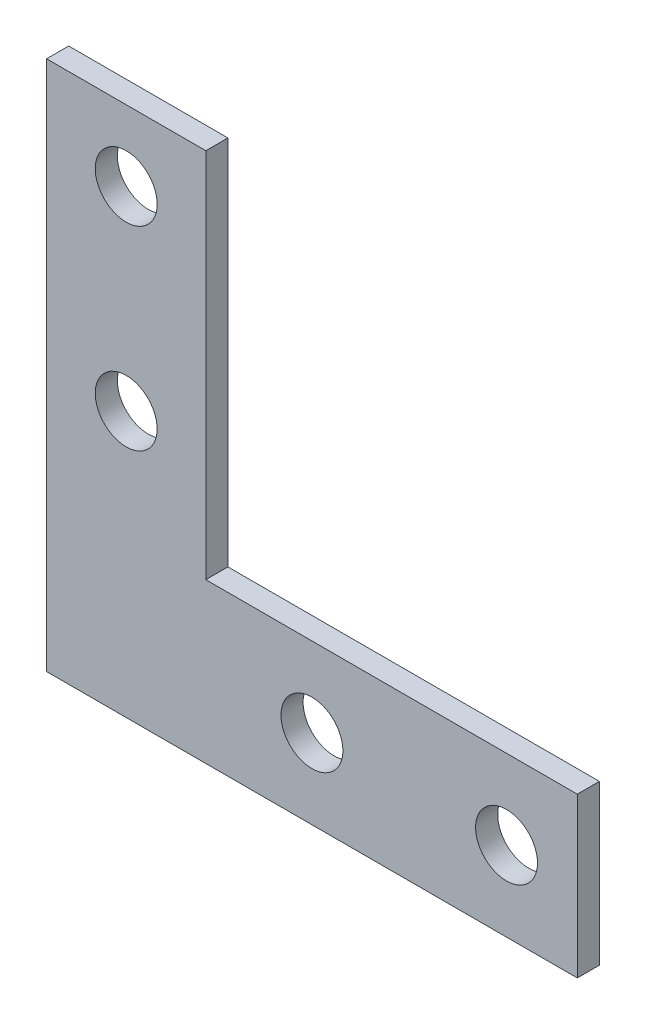
ISO-10303-21;
HEADER;
FILE_DESCRIPTION(('STEP AP214'),'2;1');
FILE_NAME('part.step','',(''),(''),'','','');
FILE_SCHEMA(('AUTOMOTIVE_DESIGN { 1 0 10303 214 1 1 1 1 }'));
ENDSEC;
DATA;
#1=APPLICATION_CONTEXT('core data for automotive mechanical design processes');
#2=APPLICATION_PROTOCOL_DEFINITION('international standard','automotive_design',2000,#1);
#3=PRODUCT_CONTEXT('',#1,'mechanical');
#4=PRODUCT('Part','Part','',(#3));
#5=PRODUCT_RELATED_PRODUCT_CATEGORY('part','',(#4));
#6=PRODUCT_DEFINITION_FORMATION('','',#4);
#7=PRODUCT_DEFINITION_CONTEXT('part definition',#1,'design');
#8=PRODUCT_DEFINITION('design','',#6,#7);
#9=PRODUCT_DEFINITION_SHAPE('','',#8);
#10=(LENGTH_UNIT() NAMED_UNIT(*) SI_UNIT(.MILLI.,.METRE.));
#11=(NAMED_UNIT(*) PLANE_ANGLE_UNIT() SI_UNIT($,.RADIAN.));
#12=(NAMED_UNIT(*) SI_UNIT($,.STERADIAN.) SOLID_ANGLE_UNIT());
#13=UNCERTAINTY_MEASURE_WITH_UNIT(LENGTH_MEASURE(1.E-05),#10,'distance_accuracy_value','');
#14=(GEOMETRIC_REPRESENTATION_CONTEXT(3) GLOBAL_UNCERTAINTY_ASSIGNED_CONTEXT((#13)) GLOBAL_UNIT_ASSIGNED_CONTEXT((#10,
#11,#12)) REPRESENTATION_CONTEXT('',''));
#15=CARTESIAN_POINT('',(0.,0.,0.));
#16=DIRECTION('',(0.,0.,1.));
#17=DIRECTION('',(1.,0.,0.));
#18=AXIS2_PLACEMENT_3D('',#15,#16,#17);
#19=CARTESIAN_POINT('',(0.,0.,2.5));
#20=DIRECTION('',(0.,0.,1.));
#21=DIRECTION('',(1.,0.,0.));
#22=AXIS2_PLACEMENT_3D('',#19,#20,#21);
#23=PLANE('',#22);
#24=CARTESIAN_POINT('',(30.,9.,2.5));
#25=DIRECTION('',(0.,0.,1.));
#26=DIRECTION('',(1.,0.,0.));
#27=AXIS2_PLACEMENT_3D('',#24,#25,#26);
#28=CIRCLE('',#27,3.5);
#29=CARTESIAN_POINT('',(33.5,9.,2.5));
#30=VERTEX_POINT('',#29);
#31=EDGE_CURVE('E190',#30,#30,#28,.T.);
#32=ORIENTED_EDGE('',*,*,#31,.F.);
#33=EDGE_LOOP('',(#32));
#34=FACE_BOUND('',#33,.T.);
#35=CARTESIAN_POINT('',(9.00000000000001,52.,2.5));
#36=DIRECTION('',(0.,0.,1.));
#37=DIRECTION('',(1.,0.,0.));
#38=AXIS2_PLACEMENT_3D('',#35,#36,#37);
#39=CIRCLE('',#38,3.5);
#40=CARTESIAN_POINT('',(12.5,52.,2.5));
#41=VERTEX_POINT('',#40);
#42=EDGE_CURVE('E123',#41,#41,#39,.T.);
#43=ORIENTED_EDGE('',*,*,#42,.F.);
#44=EDGE_LOOP('',(#43));
#45=FACE_BOUND('',#44,.T.);
#46=DIRECTION('',(-1.,0.,0.));
#47=VECTOR('',#46,1.);
#48=CARTESIAN_POINT('',(18.,60.,2.5));
#49=LINE('',#48,#47);
#50=CARTESIAN_POINT('',(18.,60.,2.5));
#51=VERTEX_POINT('',#50);
#52=CARTESIAN_POINT('',(0.,60.,2.5));
#53=VERTEX_POINT('',#52);
#54=EDGE_CURVE('E130',#51,#53,#49,.T.);
#55=ORIENTED_EDGE('',*,*,#54,.T.);
#56=DIRECTION('',(0.,-1.,0.));
#57=VECTOR('',#56,1.);
#58=CARTESIAN_POINT('',(0.,60.,2.5));
#59=LINE('',#58,#57);
#60=CARTESIAN_POINT('',(0.,0.,2.5));
#61=VERTEX_POINT('',#60);
#62=EDGE_CURVE('E88',#53,#61,#59,.T.);
#63=ORIENTED_EDGE('',*,*,#62,.T.);
#64=DIRECTION('',(1.,0.,0.));
#65=VECTOR('',#64,1.);
#66=CARTESIAN_POINT('',(0.,0.,2.5));
#67=LINE('',#66,#65);
#68=CARTESIAN_POINT('',(60.,0.,2.5));
#69=VERTEX_POINT('',#68);
#70=EDGE_CURVE('E101',#61,#69,#67,.T.);
#71=ORIENTED_EDGE('',*,*,#70,.T.);
#72=DIRECTION('',(0.,1.,0.));
#73=VECTOR('',#72,1.);
#74=CARTESIAN_POINT('',(60.,0.,2.5));
#75=LINE('',#74,#73);
#76=CARTESIAN_POINT('',(60.,18.,2.5));
#77=VERTEX_POINT('',#76);
#78=EDGE_CURVE('E95',#69,#77,#75,.T.);
#79=ORIENTED_EDGE('',*,*,#78,.T.);
#80=DIRECTION('',(-1.,0.,0.));
#81=VECTOR('',#80,1.);
#82=CARTESIAN_POINT('',(60.,18.,2.5));
#83=LINE('',#82,#81);
#84=CARTESIAN_POINT('',(18.,18.,2.5));
#85=VERTEX_POINT('',#84);
#86=EDGE_CURVE('E99',#77,#85,#83,.T.);
#87=ORIENTED_EDGE('',*,*,#86,.T.);
#88=DIRECTION('',(0.,1.,0.));
#89=VECTOR('',#88,1.);
#90=CARTESIAN_POINT('',(18.,18.,2.5));
#91=LINE('',#90,#89);
#92=EDGE_CURVE('E51',#85,#51,#91,.T.);
#93=ORIENTED_EDGE('',*,*,#92,.T.);
#94=EDGE_LOOP('',(#55,#63,#71,#79,#87,#93));
#95=FACE_BOUND('',#94,.T.);
#96=CARTESIAN_POINT('',(9.00000000000001,30.,2.5));
#97=DIRECTION('',(0.,0.,1.));
#98=DIRECTION('',(1.,0.,0.));
#99=AXIS2_PLACEMENT_3D('',#96,#97,#98);
#100=CIRCLE('',#99,3.5);
#101=CARTESIAN_POINT('',(12.5,30.,2.5));
#102=VERTEX_POINT('',#101);
#103=EDGE_CURVE('E196',#102,#102,#100,.T.);
#104=ORIENTED_EDGE('',*,*,#103,.F.);
#105=EDGE_LOOP('',(#104));
#106=FACE_BOUND('',#105,.T.);
#107=CARTESIAN_POINT('',(52.,9.,2.5));
#108=DIRECTION('',(0.,0.,1.));
#109=DIRECTION('',(1.,0.,0.));
#110=AXIS2_PLACEMENT_3D('',#107,#108,#109);
#111=CIRCLE('',#110,3.5);
#112=CARTESIAN_POINT('',(55.5,9.,2.5));
#113=VERTEX_POINT('',#112);
#114=EDGE_CURVE('E181',#113,#113,#111,.T.);
#115=ORIENTED_EDGE('',*,*,#114,.F.);
#116=EDGE_LOOP('',(#115));
#117=FACE_BOUND('',#116,.T.);
#118=ADVANCED_FACE('F34',(#34,#45,#95,#106,#117),#23,.T.);
#119=CARTESIAN_POINT('',(0.,0.,0.));
#120=DIRECTION('',(0.,0.,1.));
#121=DIRECTION('',(1.,0.,0.));
#122=AXIS2_PLACEMENT_3D('',#119,#120,#121);
#123=PLANE('',#122);
#124=DIRECTION('',(-1.,0.,0.));
#125=VECTOR('',#124,1.);
#126=CARTESIAN_POINT('',(18.,60.,0.));
#127=LINE('',#126,#125);
#128=CARTESIAN_POINT('',(18.,60.,0.));
#129=VERTEX_POINT('',#128);
#130=CARTESIAN_POINT('',(0.,60.,0.));
#131=VERTEX_POINT('',#130);
#132=EDGE_CURVE('E119',#129,#131,#127,.T.);
#133=ORIENTED_EDGE('',*,*,#132,.F.);
#134=DIRECTION('',(0.,1.,0.));
#135=VECTOR('',#134,1.);
#136=CARTESIAN_POINT('',(18.,18.,0.));
#137=LINE('',#136,#135);
#138=CARTESIAN_POINT('',(18.,18.,0.));
#139=VERTEX_POINT('',#138);
#140=EDGE_CURVE('E80',#139,#129,#137,.T.);
#141=ORIENTED_EDGE('',*,*,#140,.F.);
#142=DIRECTION('',(-1.,0.,0.));
#143=VECTOR('',#142,1.);
#144=CARTESIAN_POINT('',(60.,18.,0.));
#145=LINE('',#144,#143);
#146=CARTESIAN_POINT('',(60.,18.,0.));
#147=VERTEX_POINT('',#146);
#148=EDGE_CURVE('E74',#147,#139,#145,.T.);
#149=ORIENTED_EDGE('',*,*,#148,.F.);
#150=DIRECTION('',(0.,1.,0.));
#151=VECTOR('',#150,1.);
#152=CARTESIAN_POINT('',(60.,0.,0.));
#153=LINE('',#152,#151);
#154=CARTESIAN_POINT('',(60.,0.,0.));
#155=VERTEX_POINT('',#154);
#156=EDGE_CURVE('E109',#155,#147,#153,.T.);
#157=ORIENTED_EDGE('',*,*,#156,.F.);
#158=DIRECTION('',(1.,0.,0.));
#159=VECTOR('',#158,1.);
#160=CARTESIAN_POINT('',(0.,0.,0.));
#161=LINE('',#160,#159);
#162=CARTESIAN_POINT('',(0.,0.,0.));
#163=VERTEX_POINT('',#162);
#164=EDGE_CURVE('E125',#163,#155,#161,.T.);
#165=ORIENTED_EDGE('',*,*,#164,.F.);
#166=DIRECTION('',(0.,-1.,0.));
#167=VECTOR('',#166,1.);
#168=CARTESIAN_POINT('',(0.,60.,0.));
#169=LINE('',#168,#167);
#170=EDGE_CURVE('E122',#131,#163,#169,.T.);
#171=ORIENTED_EDGE('',*,*,#170,.F.);
#172=EDGE_LOOP('',(#133,#141,#149,#157,#165,#171));
#173=FACE_BOUND('',#172,.T.);
#174=CARTESIAN_POINT('',(9.00000000000001,52.,0.));
#175=DIRECTION('',(0.,0.,1.));
#176=DIRECTION('',(1.,0.,0.));
#177=AXIS2_PLACEMENT_3D('',#174,#175,#176);
#178=CIRCLE('',#177,3.5);
#179=CARTESIAN_POINT('',(12.5,52.,0.));
#180=VERTEX_POINT('',#179);
#181=EDGE_CURVE('E199',#180,#180,#178,.T.);
#182=ORIENTED_EDGE('',*,*,#181,.T.);
#183=EDGE_LOOP('',(#182));
#184=FACE_BOUND('',#183,.T.);
#185=CARTESIAN_POINT('',(9.00000000000001,30.,0.));
#186=DIRECTION('',(0.,0.,1.));
#187=DIRECTION('',(1.,0.,0.));
#188=AXIS2_PLACEMENT_3D('',#185,#186,#187);
#189=CIRCLE('',#188,3.5);
#190=CARTESIAN_POINT('',(12.5,30.,0.));
#191=VERTEX_POINT('',#190);
#192=EDGE_CURVE('E193',#191,#191,#189,.T.);
#193=ORIENTED_EDGE('',*,*,#192,.T.);
#194=EDGE_LOOP('',(#193));
#195=FACE_BOUND('',#194,.T.);
#196=CARTESIAN_POINT('',(30.,9.,0.));
#197=DIRECTION('',(0.,0.,1.));
#198=DIRECTION('',(1.,0.,0.));
#199=AXIS2_PLACEMENT_3D('',#196,#197,#198);
#200=CIRCLE('',#199,3.5);
#201=CARTESIAN_POINT('',(33.5,9.,0.));
#202=VERTEX_POINT('',#201);
#203=EDGE_CURVE('E187',#202,#202,#200,.T.);
#204=ORIENTED_EDGE('',*,*,#203,.T.);
#205=EDGE_LOOP('',(#204));
#206=FACE_BOUND('',#205,.T.);
#207=CARTESIAN_POINT('',(52.,9.,0.));
#208=DIRECTION('',(0.,0.,1.));
#209=DIRECTION('',(1.,0.,0.));
#210=AXIS2_PLACEMENT_3D('',#207,#208,#209);
#211=CIRCLE('',#210,3.5);
#212=CARTESIAN_POINT('',(55.5,9.,0.));
#213=VERTEX_POINT('',#212);
#214=EDGE_CURVE('E184',#213,#213,#211,.T.);
#215=ORIENTED_EDGE('',*,*,#214,.T.);
#216=EDGE_LOOP('',(#215));
#217=FACE_BOUND('',#216,.T.);
#218=ADVANCED_FACE('F139',(#173,#184,#195,#206,#217),#123,.F.);
#219=CARTESIAN_POINT('',(18.,60.,2.5));
#220=DIRECTION('',(0.,-1.,0.));
#221=DIRECTION('',(0.,0.,-1.));
#222=AXIS2_PLACEMENT_3D('',#219,#220,#221);
#223=PLANE('',#222);
#224=ORIENTED_EDGE('',*,*,#132,.T.);
#225=DIRECTION('',(0.,0.,-1.));
#226=VECTOR('',#225,1.);
#227=CARTESIAN_POINT('',(0.,60.,2.5));
#228=LINE('',#227,#226);
#229=EDGE_CURVE('E11',#53,#131,#228,.T.);
#230=ORIENTED_EDGE('',*,*,#229,.F.);
#231=ORIENTED_EDGE('',*,*,#54,.F.);
#232=DIRECTION('',(0.,0.,-1.));
#233=VECTOR('',#232,1.);
#234=CARTESIAN_POINT('',(18.,60.,2.5));
#235=LINE('',#234,#233);
#236=EDGE_CURVE('E115',#51,#129,#235,.T.);
#237=ORIENTED_EDGE('',*,*,#236,.T.);
#238=EDGE_LOOP('',(#224,#230,#231,#237));
#239=FACE_BOUND('',#238,.T.);
#240=ADVANCED_FACE('F36',(#239),#223,.F.);
#241=CARTESIAN_POINT('',(0.,60.,2.5));
#242=DIRECTION('',(1.,0.,0.));
#243=DIRECTION('',(0.,1.,0.));
#244=AXIS2_PLACEMENT_3D('',#241,#242,#243);
#245=PLANE('',#244);
#246=ORIENTED_EDGE('',*,*,#170,.T.);
#247=DIRECTION('',(0.,0.,-1.));
#248=VECTOR('',#247,1.);
#249=CARTESIAN_POINT('',(0.,0.,2.5));
#250=LINE('',#249,#248);
#251=EDGE_CURVE('E43',#61,#163,#250,.T.);
#252=ORIENTED_EDGE('',*,*,#251,.F.);
#253=ORIENTED_EDGE('',*,*,#62,.F.);
#254=ORIENTED_EDGE('',*,*,#229,.T.);
#255=EDGE_LOOP('',(#246,#252,#253,#254));
#256=FACE_BOUND('',#255,.T.);
#257=ADVANCED_FACE('F257',(#256),#245,.F.);
#258=CARTESIAN_POINT('',(0.,0.,2.5));
#259=DIRECTION('',(0.,1.,0.));
#260=DIRECTION('',(0.,0.,1.));
#261=AXIS2_PLACEMENT_3D('',#258,#259,#260);
#262=PLANE('',#261);
#263=ORIENTED_EDGE('',*,*,#164,.T.);
#264=DIRECTION('',(0.,0.,-1.));
#265=VECTOR('',#264,1.);
#266=CARTESIAN_POINT('',(60.,0.,2.5));
#267=LINE('',#266,#265);
#268=EDGE_CURVE('E110',#69,#155,#267,.T.);
#269=ORIENTED_EDGE('',*,*,#268,.F.);
#270=ORIENTED_EDGE('',*,*,#70,.F.);
#271=ORIENTED_EDGE('',*,*,#251,.T.);
#272=EDGE_LOOP('',(#263,#269,#270,#271));
#273=FACE_BOUND('',#272,.T.);
#274=ADVANCED_FACE('F136',(#273),#262,.F.);
#275=CARTESIAN_POINT('',(60.,0.,2.5));
#276=DIRECTION('',(-1.,0.,0.));
#277=DIRECTION('',(0.,0.,1.));
#278=AXIS2_PLACEMENT_3D('',#275,#276,#277);
#279=PLANE('',#278);
#280=ORIENTED_EDGE('',*,*,#156,.T.);
#281=DIRECTION('',(0.,0.,-1.));
#282=VECTOR('',#281,1.);
#283=CARTESIAN_POINT('',(60.,18.,2.5));
#284=LINE('',#283,#282);
#285=EDGE_CURVE('E106',#77,#147,#284,.T.);
#286=ORIENTED_EDGE('',*,*,#285,.F.);
#287=ORIENTED_EDGE('',*,*,#78,.F.);
#288=ORIENTED_EDGE('',*,*,#268,.T.);
#289=EDGE_LOOP('',(#280,#286,#287,#288));
#290=FACE_BOUND('',#289,.T.);
#291=ADVANCED_FACE('F107',(#290),#279,.F.);
#292=CARTESIAN_POINT('',(60.,18.,2.5));
#293=DIRECTION('',(0.,-1.,0.));
#294=DIRECTION('',(1.,0.,0.));
#295=AXIS2_PLACEMENT_3D('',#292,#293,#294);
#296=PLANE('',#295);
#297=ORIENTED_EDGE('',*,*,#148,.T.);
#298=DIRECTION('',(0.,0.,-1.));
#299=VECTOR('',#298,1.);
#300=CARTESIAN_POINT('',(18.,18.,2.5));
#301=LINE('',#300,#299);
#302=EDGE_CURVE('E111',#85,#139,#301,.T.);
#303=ORIENTED_EDGE('',*,*,#302,.F.);
#304=ORIENTED_EDGE('',*,*,#86,.F.);
#305=ORIENTED_EDGE('',*,*,#285,.T.);
#306=EDGE_LOOP('',(#297,#303,#304,#305));
#307=FACE_BOUND('',#306,.T.);
#308=ADVANCED_FACE('F113',(#307),#296,.F.);
#309=CARTESIAN_POINT('',(18.,18.,2.5));
#310=DIRECTION('',(-1.,0.,0.));
#311=DIRECTION('',(0.,0.,1.));
#312=AXIS2_PLACEMENT_3D('',#309,#310,#311);
#313=PLANE('',#312);
#314=ORIENTED_EDGE('',*,*,#140,.T.);
#315=ORIENTED_EDGE('',*,*,#236,.F.);
#316=ORIENTED_EDGE('',*,*,#92,.F.);
#317=ORIENTED_EDGE('',*,*,#302,.T.);
#318=EDGE_LOOP('',(#314,#315,#316,#317));
#319=FACE_BOUND('',#318,.T.);
#320=ADVANCED_FACE('F144',(#319),#313,.F.);
#321=CARTESIAN_POINT('',(9.00000000000001,52.,2.5));
#322=DIRECTION('',(0.,0.,-1.));
#323=DIRECTION('',(-1.,0.,0.));
#324=AXIS2_PLACEMENT_3D('',#321,#322,#323);
#325=CYLINDRICAL_SURFACE('',#324,3.5);
#326=ORIENTED_EDGE('',*,*,#42,.T.);
#327=EDGE_LOOP('',(#326));
#328=FACE_BOUND('',#327,.T.);
#329=ORIENTED_EDGE('',*,*,#181,.F.);
#330=EDGE_LOOP('',(#329));
#331=FACE_BOUND('',#330,.T.);
#332=ADVANCED_FACE('F146',(#328,#331),#325,.F.);
#333=CARTESIAN_POINT('',(9.00000000000001,30.,2.5));
#334=DIRECTION('',(0.,0.,-1.));
#335=DIRECTION('',(-1.,0.,0.));
#336=AXIS2_PLACEMENT_3D('',#333,#334,#335);
#337=CYLINDRICAL_SURFACE('',#336,3.5);
#338=ORIENTED_EDGE('',*,*,#103,.T.);
#339=EDGE_LOOP('',(#338));
#340=FACE_BOUND('',#339,.T.);
#341=ORIENTED_EDGE('',*,*,#192,.F.);
#342=EDGE_LOOP('',(#341));
#343=FACE_BOUND('',#342,.T.);
#344=ADVANCED_FACE('F152',(#340,#343),#337,.F.);
#345=CARTESIAN_POINT('',(30.,9.,2.5));
#346=DIRECTION('',(0.,0.,-1.));
#347=DIRECTION('',(-1.,0.,0.));
#348=AXIS2_PLACEMENT_3D('',#345,#346,#347);
#349=CYLINDRICAL_SURFACE('',#348,3.5);
#350=ORIENTED_EDGE('',*,*,#31,.T.);
#351=EDGE_LOOP('',(#350));
#352=FACE_BOUND('',#351,.T.);
#353=ORIENTED_EDGE('',*,*,#203,.F.);
#354=EDGE_LOOP('',(#353));
#355=FACE_BOUND('',#354,.T.);
#356=ADVANCED_FACE('F168',(#352,#355),#349,.F.);
#357=CARTESIAN_POINT('',(52.,9.,2.5));
#358=DIRECTION('',(0.,0.,-1.));
#359=DIRECTION('',(-1.,0.,0.));
#360=AXIS2_PLACEMENT_3D('',#357,#358,#359);
#361=CYLINDRICAL_SURFACE('',#360,3.5);
#362=ORIENTED_EDGE('',*,*,#114,.T.);
#363=EDGE_LOOP('',(#362));
#364=FACE_BOUND('',#363,.T.);
#365=ORIENTED_EDGE('',*,*,#214,.F.);
#366=EDGE_LOOP('',(#365));
#367=FACE_BOUND('',#366,.T.);
#368=ADVANCED_FACE('F172',(#364,#367),#361,.F.);
#369=CLOSED_SHELL('',(#118,#218,#240,#257,#274,#291,#308,#320,#332,#344,#356,#368));
#370=MANIFOLD_SOLID_BREP('B2',#369);
#371=ADVANCED_BREP_SHAPE_REPRESENTATION('',(#18,#370),#14);
#372=SHAPE_DEFINITION_REPRESENTATION(#9,#371);
ENDSEC;
END-ISO-10303-21;
